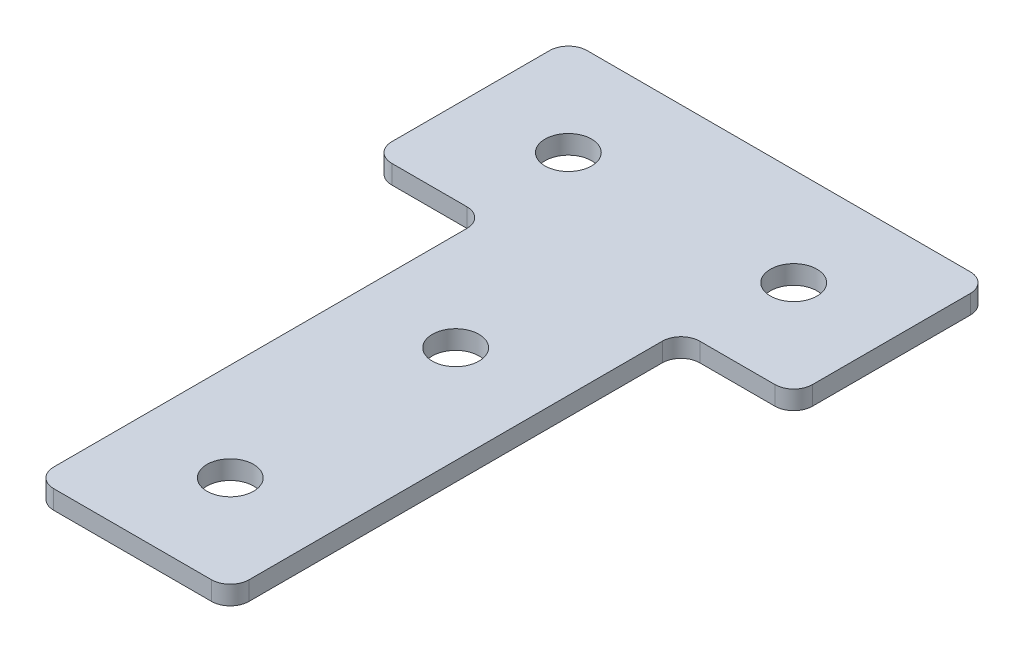
ISO-10303-21;
HEADER;
FILE_DESCRIPTION(('STEP AP214'),'2;1');
FILE_NAME('part.step','',(''),(''),'','','');
FILE_SCHEMA(('AUTOMOTIVE_DESIGN { 1 0 10303 214 1 1 1 1 }'));
ENDSEC;
DATA;
#1=APPLICATION_CONTEXT('core data for automotive mechanical design processes');
#2=APPLICATION_PROTOCOL_DEFINITION('international standard','automotive_design',2000,#1);
#3=PRODUCT_CONTEXT('',#1,'mechanical');
#4=PRODUCT('Part','Part','',(#3));
#5=PRODUCT_RELATED_PRODUCT_CATEGORY('part','',(#4));
#6=PRODUCT_DEFINITION_FORMATION('','',#4);
#7=PRODUCT_DEFINITION_CONTEXT('part definition',#1,'design');
#8=PRODUCT_DEFINITION('design','',#6,#7);
#9=PRODUCT_DEFINITION_SHAPE('','',#8);
#10=(LENGTH_UNIT() NAMED_UNIT(*) SI_UNIT(.MILLI.,.METRE.));
#11=(NAMED_UNIT(*) PLANE_ANGLE_UNIT() SI_UNIT($,.RADIAN.));
#12=(NAMED_UNIT(*) SI_UNIT($,.STERADIAN.) SOLID_ANGLE_UNIT());
#13=UNCERTAINTY_MEASURE_WITH_UNIT(LENGTH_MEASURE(1.E-05),#10,'distance_accuracy_value','');
#14=(GEOMETRIC_REPRESENTATION_CONTEXT(3) GLOBAL_UNCERTAINTY_ASSIGNED_CONTEXT((#13)) GLOBAL_UNIT_ASSIGNED_CONTEXT((#10,
#11,#12)) REPRESENTATION_CONTEXT('',''));
#15=CARTESIAN_POINT('',(0.,0.,0.));
#16=DIRECTION('',(0.,0.,1.));
#17=DIRECTION('',(1.,0.,0.));
#18=AXIS2_PLACEMENT_3D('',#15,#16,#17);
#19=CARTESIAN_POINT('',(-1.96602308443516,2.10790424423976,-31.3913354505916));
#20=DIRECTION('',(0.,-1.,0.));
#21=DIRECTION('',(0.,0.,-1.));
#22=AXIS2_PLACEMENT_3D('',#19,#20,#21);
#23=PLANE('',#22);
#24=CARTESIAN_POINT('',(-1.96602308443517,2.10790424423976,-1.39133545059163));
#25=DIRECTION('',(0.,1.,0.));
#26=DIRECTION('',(0.,0.,1.));
#27=AXIS2_PLACEMENT_3D('',#24,#25,#26);
#28=CIRCLE('',#27,3.1);
#29=CARTESIAN_POINT('',(-1.96602308443517,2.10790424423976,1.70866454940837));
#30=VERTEX_POINT('',#29);
#31=EDGE_CURVE('E206',#30,#30,#28,.T.);
#32=ORIENTED_EDGE('',*,*,#31,.T.);
#33=EDGE_LOOP('',(#32));
#34=FACE_BOUND('',#33,.T.);
#35=DIRECTION('',(1.,0.,0.));
#36=VECTOR('',#35,1.);
#37=CARTESIAN_POINT('',(-14.9660230844353,2.10790424423976,41.6086645494083));
#38=LINE('',#37,#36);
#39=CARTESIAN_POINT('',(-12.4660230844353,2.10790424423976,41.6086645494083));
#40=VERTEX_POINT('',#39);
#41=CARTESIAN_POINT('',(8.53397691556495,2.10790424423976,41.6086645494083));
#42=VERTEX_POINT('',#41);
#43=EDGE_CURVE('E224',#40,#42,#38,.T.);
#44=ORIENTED_EDGE('',*,*,#43,.F.);
#45=CARTESIAN_POINT('',(-12.4660230844353,2.10790424423976,39.1086645494083));
#46=DIRECTION('',(0.,1.,0.));
#47=DIRECTION('',(0.,0.,-1.));
#48=AXIS2_PLACEMENT_3D('',#45,#46,#47);
#49=CIRCLE('',#48,2.5);
#50=CARTESIAN_POINT('',(-14.9660230844353,2.10790424423976,39.1086645494083));
#51=VERTEX_POINT('',#50);
#52=EDGE_CURVE('E156',#51,#40,#49,.T.);
#53=ORIENTED_EDGE('',*,*,#52,.F.);
#54=DIRECTION('',(0.,0.,-1.));
#55=VECTOR('',#54,1.);
#56=CARTESIAN_POINT('',(-14.9660230844353,2.10790424423976,41.6086645494083));
#57=LINE('',#56,#55);
#58=CARTESIAN_POINT('',(-14.9660230844353,2.10790424423976,-15.8913354505916));
#59=VERTEX_POINT('',#58);
#60=EDGE_CURVE('E163',#51,#59,#57,.T.);
#61=ORIENTED_EDGE('',*,*,#60,.T.);
#62=CARTESIAN_POINT('',(-17.4660230844353,2.10790424423976,-15.8913354505916));
#63=DIRECTION('',(0.,1.,0.));
#64=DIRECTION('',(0.,0.,-1.));
#65=AXIS2_PLACEMENT_3D('',#62,#63,#64);
#66=CIRCLE('',#65,2.5);
#67=CARTESIAN_POINT('',(-17.4660230844353,2.10790424423976,-18.3913354505916));
#68=VERTEX_POINT('',#67);
#69=EDGE_CURVE('E196',#68,#59,#66,.F.);
#70=ORIENTED_EDGE('',*,*,#69,.F.);
#71=DIRECTION('',(-1.,0.,0.));
#72=VECTOR('',#71,1.);
#73=CARTESIAN_POINT('',(-14.9660230844353,2.10790424423976,-18.3913354505916));
#74=LINE('',#73,#72);
#75=CARTESIAN_POINT('',(-27.466023084435,2.10790424423976,-18.3913354505916));
#76=VERTEX_POINT('',#75);
#77=EDGE_CURVE('E158',#68,#76,#74,.T.);
#78=ORIENTED_EDGE('',*,*,#77,.T.);
#79=CARTESIAN_POINT('',(-27.466023084435,2.10790424423976,-20.8913354505916));
#80=DIRECTION('',(0.,1.,0.));
#81=DIRECTION('',(0.,0.,-1.));
#82=AXIS2_PLACEMENT_3D('',#79,#80,#81);
#83=CIRCLE('',#82,2.5);
#84=CARTESIAN_POINT('',(-29.966023084435,2.10790424423976,-20.8913354505916));
#85=VERTEX_POINT('',#84);
#86=EDGE_CURVE('E177',#85,#76,#83,.T.);
#87=ORIENTED_EDGE('',*,*,#86,.F.);
#88=DIRECTION('',(0.,0.,-1.));
#89=VECTOR('',#88,1.);
#90=CARTESIAN_POINT('',(-29.966023084435,2.10790424423976,-18.3913354505916));
#91=LINE('',#90,#89);
#92=CARTESIAN_POINT('',(-29.9660230844351,2.10790424423976,-41.8913354505917));
#93=VERTEX_POINT('',#92);
#94=EDGE_CURVE('E285',#85,#93,#91,.T.);
#95=ORIENTED_EDGE('',*,*,#94,.T.);
#96=CARTESIAN_POINT('',(-27.4660230844351,2.10790424423976,-41.8913354505917));
#97=DIRECTION('',(0.,1.,0.));
#98=DIRECTION('',(0.,0.,-1.));
#99=AXIS2_PLACEMENT_3D('',#96,#97,#98);
#100=CIRCLE('',#99,2.5);
#101=CARTESIAN_POINT('',(-27.4660230844351,2.10790424423976,-44.3913354505917));
#102=VERTEX_POINT('',#101);
#103=EDGE_CURVE('E174',#102,#93,#100,.T.);
#104=ORIENTED_EDGE('',*,*,#103,.F.);
#105=DIRECTION('',(-1.,0.,0.));
#106=VECTOR('',#105,1.);
#107=CARTESIAN_POINT('',(26.0339769155647,2.10790424423976,-44.3913354505917));
#108=LINE('',#107,#106);
#109=CARTESIAN_POINT('',(23.5339769155647,2.10790424423976,-44.3913354505917));
#110=VERTEX_POINT('',#109);
#111=EDGE_CURVE('E221',#110,#102,#108,.T.);
#112=ORIENTED_EDGE('',*,*,#111,.F.);
#113=CARTESIAN_POINT('',(23.5339769155647,2.10790424423976,-41.8913354505917));
#114=DIRECTION('',(0.,-1.,0.));
#115=DIRECTION('',(0.,0.,-1.));
#116=AXIS2_PLACEMENT_3D('',#113,#114,#115);
#117=CIRCLE('',#116,2.5);
#118=CARTESIAN_POINT('',(26.0339769155647,2.10790424423976,-41.8913354505917));
#119=VERTEX_POINT('',#118);
#120=EDGE_CURVE('E250',#110,#119,#117,.T.);
#121=ORIENTED_EDGE('',*,*,#120,.T.);
#122=DIRECTION('',(0.,0.,-1.));
#123=VECTOR('',#122,1.);
#124=CARTESIAN_POINT('',(26.0339769155647,2.10790424423976,-18.3913354505916));
#125=LINE('',#124,#123);
#126=CARTESIAN_POINT('',(26.0339769155647,2.10790424423976,-20.8913354505916));
#127=VERTEX_POINT('',#126);
#128=EDGE_CURVE('E218',#127,#119,#125,.T.);
#129=ORIENTED_EDGE('',*,*,#128,.F.);
#130=CARTESIAN_POINT('',(23.5339769155647,2.10790424423976,-20.8913354505916));
#131=DIRECTION('',(0.,-1.,0.));
#132=DIRECTION('',(0.,0.,-1.));
#133=AXIS2_PLACEMENT_3D('',#130,#131,#132);
#134=CIRCLE('',#133,2.5);
#135=CARTESIAN_POINT('',(23.5339769155647,2.10790424423976,-18.3913354505916));
#136=VERTEX_POINT('',#135);
#137=EDGE_CURVE('E31',#127,#136,#134,.T.);
#138=ORIENTED_EDGE('',*,*,#137,.T.);
#139=DIRECTION('',(1.,0.,0.));
#140=VECTOR('',#139,1.);
#141=CARTESIAN_POINT('',(11.0339769155649,2.10790424423976,-18.3913354505916));
#142=LINE('',#141,#140);
#143=CARTESIAN_POINT('',(13.5339769155649,2.10790424423976,-18.3913354505916));
#144=VERTEX_POINT('',#143);
#145=EDGE_CURVE('E229',#144,#136,#142,.T.);
#146=ORIENTED_EDGE('',*,*,#145,.F.);
#147=CARTESIAN_POINT('',(13.5339769155649,2.10790424423976,-15.8913354505916));
#148=DIRECTION('',(0.,-1.,0.));
#149=DIRECTION('',(0.,0.,-1.));
#150=AXIS2_PLACEMENT_3D('',#147,#148,#149);
#151=CIRCLE('',#150,2.5);
#152=CARTESIAN_POINT('',(11.0339769155649,2.10790424423976,-15.8913354505916));
#153=VERTEX_POINT('',#152);
#154=EDGE_CURVE('E10',#144,#153,#151,.F.);
#155=ORIENTED_EDGE('',*,*,#154,.T.);
#156=DIRECTION('',(0.,0.,-1.));
#157=VECTOR('',#156,1.);
#158=CARTESIAN_POINT('',(11.0339769155649,2.10790424423976,41.6086645494083));
#159=LINE('',#158,#157);
#160=CARTESIAN_POINT('',(11.0339769155649,2.10790424423976,39.1086645494083));
#161=VERTEX_POINT('',#160);
#162=EDGE_CURVE('E226',#161,#153,#159,.T.);
#163=ORIENTED_EDGE('',*,*,#162,.F.);
#164=CARTESIAN_POINT('',(8.53397691556495,2.10790424423976,39.1086645494083));
#165=DIRECTION('',(0.,-1.,0.));
#166=DIRECTION('',(0.,0.,-1.));
#167=AXIS2_PLACEMENT_3D('',#164,#165,#166);
#168=CIRCLE('',#167,2.5);
#169=EDGE_CURVE('E253',#161,#42,#168,.T.);
#170=ORIENTED_EDGE('',*,*,#169,.T.);
#171=EDGE_LOOP('',(#44,#53,#61,#70,#78,#87,#95,#104,#112,#121,#129,#138,#146,#155,#163,#170));
#172=FACE_BOUND('',#171,.T.);
#173=CARTESIAN_POINT('',(-1.96602308443517,2.10790424423976,28.6086645494084));
#174=DIRECTION('',(0.,1.,0.));
#175=DIRECTION('',(0.,0.,1.));
#176=AXIS2_PLACEMENT_3D('',#173,#174,#175);
#177=CIRCLE('',#176,3.1);
#178=CARTESIAN_POINT('',(-1.96602308443517,2.10790424423976,31.7086645494084));
#179=VERTEX_POINT('',#178);
#180=EDGE_CURVE('E200',#179,#179,#177,.T.);
#181=ORIENTED_EDGE('',*,*,#180,.T.);
#182=EDGE_LOOP('',(#181));
#183=FACE_BOUND('',#182,.T.);
#184=CARTESIAN_POINT('',(13.0339769155648,2.10790424423976,-31.3913354505916));
#185=DIRECTION('',(0.,1.,0.));
#186=DIRECTION('',(0.,0.,1.));
#187=AXIS2_PLACEMENT_3D('',#184,#185,#186);
#188=CIRCLE('',#187,3.1);
#189=CARTESIAN_POINT('',(13.0339769155648,2.10790424423976,-28.2913354505916));
#190=VERTEX_POINT('',#189);
#191=EDGE_CURVE('E212',#190,#190,#188,.T.);
#192=ORIENTED_EDGE('',*,*,#191,.T.);
#193=EDGE_LOOP('',(#192));
#194=FACE_BOUND('',#193,.T.);
#195=CARTESIAN_POINT('',(-16.9660230844352,2.10790424423976,-31.3913354505916));
#196=DIRECTION('',(0.,-1.,0.));
#197=DIRECTION('',(0.,0.,1.));
#198=AXIS2_PLACEMENT_3D('',#195,#196,#197);
#199=CIRCLE('',#198,3.1);
#200=CARTESIAN_POINT('',(-16.9660230844352,2.10790424423976,-28.2913354505916));
#201=VERTEX_POINT('',#200);
#202=EDGE_CURVE('E293',#201,#201,#199,.T.);
#203=ORIENTED_EDGE('',*,*,#202,.F.);
#204=EDGE_LOOP('',(#203));
#205=FACE_BOUND('',#204,.T.);
#206=ADVANCED_FACE('F16',(#34,#172,#183,#194,#205),#23,.T.);
#207=CARTESIAN_POINT('',(26.0339769155647,2.10790424423976,-18.3913354505916));
#208=DIRECTION('',(1.,0.,0.));
#209=DIRECTION('',(0.,0.,-1.));
#210=AXIS2_PLACEMENT_3D('',#207,#208,#209);
#211=PLANE('',#210);
#212=DIRECTION('',(0.,0.,-1.));
#213=VECTOR('',#212,1.);
#214=CARTESIAN_POINT('',(26.0339769155647,4.60790424423976,-18.3913354505916));
#215=LINE('',#214,#213);
#216=CARTESIAN_POINT('',(26.0339769155647,4.60790424423976,-20.8913354505916));
#217=VERTEX_POINT('',#216);
#218=CARTESIAN_POINT('',(26.0339769155647,4.60790424423976,-41.8913354505917));
#219=VERTEX_POINT('',#218);
#220=EDGE_CURVE('E215',#217,#219,#215,.T.);
#221=ORIENTED_EDGE('',*,*,#220,.F.);
#222=DIRECTION('',(0.,1.,0.));
#223=VECTOR('',#222,1.);
#224=CARTESIAN_POINT('',(26.0339769155647,2.10790424423976,-20.8913354505916));
#225=LINE('',#224,#223);
#226=EDGE_CURVE('E263',#217,#127,#225,.F.);
#227=ORIENTED_EDGE('',*,*,#226,.T.);
#228=ORIENTED_EDGE('',*,*,#128,.T.);
#229=DIRECTION('',(0.,1.,0.));
#230=VECTOR('',#229,1.);
#231=CARTESIAN_POINT('',(26.0339769155647,2.10790424423976,-41.8913354505917));
#232=LINE('',#231,#230);
#233=EDGE_CURVE('E260',#119,#219,#232,.T.);
#234=ORIENTED_EDGE('',*,*,#233,.T.);
#235=EDGE_LOOP('',(#221,#227,#228,#234));
#236=FACE_BOUND('',#235,.T.);
#237=ADVANCED_FACE('F322',(#236),#211,.T.);
#238=CARTESIAN_POINT('',(11.0339769155649,2.10790424423976,-18.3913354505916));
#239=DIRECTION('',(0.,0.,1.));
#240=DIRECTION('',(1.,0.,0.));
#241=AXIS2_PLACEMENT_3D('',#238,#239,#240);
#242=PLANE('',#241);
#243=DIRECTION('',(1.,0.,0.));
#244=VECTOR('',#243,1.);
#245=CARTESIAN_POINT('',(11.0339769155649,4.60790424423976,-18.3913354505916));
#246=LINE('',#245,#244);
#247=CARTESIAN_POINT('',(13.5339769155649,4.60790424423976,-18.3913354505916));
#248=VERTEX_POINT('',#247);
#249=CARTESIAN_POINT('',(23.5339769155647,4.60790424423976,-18.3913354505916));
#250=VERTEX_POINT('',#249);
#251=EDGE_CURVE('E222',#248,#250,#246,.T.);
#252=ORIENTED_EDGE('',*,*,#251,.F.);
#253=DIRECTION('',(0.,1.,0.));
#254=VECTOR('',#253,1.);
#255=CARTESIAN_POINT('',(13.5339769155649,2.10790424423976,-18.3913354505916));
#256=LINE('',#255,#254);
#257=EDGE_CURVE('E38',#248,#144,#256,.F.);
#258=ORIENTED_EDGE('',*,*,#257,.T.);
#259=ORIENTED_EDGE('',*,*,#145,.T.);
#260=DIRECTION('',(0.,1.,0.));
#261=VECTOR('',#260,1.);
#262=CARTESIAN_POINT('',(23.5339769155647,2.10790424423976,-18.3913354505916));
#263=LINE('',#262,#261);
#264=EDGE_CURVE('E256',#136,#250,#263,.T.);
#265=ORIENTED_EDGE('',*,*,#264,.T.);
#266=EDGE_LOOP('',(#252,#258,#259,#265));
#267=FACE_BOUND('',#266,.T.);
#268=ADVANCED_FACE('F269',(#267),#242,.T.);
#269=CARTESIAN_POINT('',(11.0339769155649,2.10790424423976,41.6086645494083));
#270=DIRECTION('',(1.,0.,0.));
#271=DIRECTION('',(0.,0.,-1.));
#272=AXIS2_PLACEMENT_3D('',#269,#270,#271);
#273=PLANE('',#272);
#274=DIRECTION('',(0.,0.,-1.));
#275=VECTOR('',#274,1.);
#276=CARTESIAN_POINT('',(11.0339769155649,4.60790424423976,41.6086645494083));
#277=LINE('',#276,#275);
#278=CARTESIAN_POINT('',(11.0339769155649,4.60790424423976,39.1086645494083));
#279=VERTEX_POINT('',#278);
#280=CARTESIAN_POINT('',(11.0339769155649,4.60790424423976,-15.8913354505916));
#281=VERTEX_POINT('',#280);
#282=EDGE_CURVE('E140',#279,#281,#277,.T.);
#283=ORIENTED_EDGE('',*,*,#282,.F.);
#284=DIRECTION('',(0.,1.,0.));
#285=VECTOR('',#284,1.);
#286=CARTESIAN_POINT('',(11.0339769155649,2.10790424423976,39.1086645494083));
#287=LINE('',#286,#285);
#288=EDGE_CURVE('E248',#279,#161,#287,.F.);
#289=ORIENTED_EDGE('',*,*,#288,.T.);
#290=ORIENTED_EDGE('',*,*,#162,.T.);
#291=DIRECTION('',(0.,1.,0.));
#292=VECTOR('',#291,1.);
#293=CARTESIAN_POINT('',(11.0339769155649,4.60790424423976,-15.8913354505916));
#294=LINE('',#293,#292);
#295=EDGE_CURVE('E245',#153,#281,#294,.T.);
#296=ORIENTED_EDGE('',*,*,#295,.T.);
#297=EDGE_LOOP('',(#283,#289,#290,#296));
#298=FACE_BOUND('',#297,.T.);
#299=ADVANCED_FACE('F277',(#298),#273,.T.);
#300=CARTESIAN_POINT('',(-14.9660230844353,2.10790424423976,41.6086645494083));
#301=DIRECTION('',(0.,0.,1.));
#302=DIRECTION('',(1.,0.,0.));
#303=AXIS2_PLACEMENT_3D('',#300,#301,#302);
#304=PLANE('',#303);
#305=DIRECTION('',(1.,0.,0.));
#306=VECTOR('',#305,1.);
#307=CARTESIAN_POINT('',(-14.9660230844353,4.60790424423976,41.6086645494083));
#308=LINE('',#307,#306);
#309=CARTESIAN_POINT('',(-12.4660230844353,4.60790424423976,41.6086645494083));
#310=VERTEX_POINT('',#309);
#311=CARTESIAN_POINT('',(8.53397691556495,4.60790424423976,41.6086645494083));
#312=VERTEX_POINT('',#311);
#313=EDGE_CURVE('E130',#310,#312,#308,.T.);
#314=ORIENTED_EDGE('',*,*,#313,.F.);
#315=DIRECTION('',(0.,1.,0.));
#316=VECTOR('',#315,1.);
#317=CARTESIAN_POINT('',(-12.4660230844353,2.10790424423976,41.6086645494083));
#318=LINE('',#317,#316);
#319=EDGE_CURVE('E134',#40,#310,#318,.T.);
#320=ORIENTED_EDGE('',*,*,#319,.F.);
#321=ORIENTED_EDGE('',*,*,#43,.T.);
#322=DIRECTION('',(0.,1.,0.));
#323=VECTOR('',#322,1.);
#324=CARTESIAN_POINT('',(8.53397691556495,2.10790424423976,41.6086645494083));
#325=LINE('',#324,#323);
#326=EDGE_CURVE('E137',#42,#312,#325,.T.);
#327=ORIENTED_EDGE('',*,*,#326,.T.);
#328=EDGE_LOOP('',(#314,#320,#321,#327));
#329=FACE_BOUND('',#328,.T.);
#330=ADVANCED_FACE('F132',(#329),#304,.T.);
#331=CARTESIAN_POINT('',(26.0339769155647,2.10790424423976,-44.3913354505917));
#332=DIRECTION('',(0.,0.,-1.));
#333=DIRECTION('',(-1.,0.,0.));
#334=AXIS2_PLACEMENT_3D('',#331,#332,#333);
#335=PLANE('',#334);
#336=ORIENTED_EDGE('',*,*,#111,.T.);
#337=DIRECTION('',(0.,1.,0.));
#338=VECTOR('',#337,1.);
#339=CARTESIAN_POINT('',(-27.4660230844351,2.10790424423976,-44.3913354505917));
#340=LINE('',#339,#338);
#341=CARTESIAN_POINT('',(-27.4660230844351,4.60790424423976,-44.3913354505917));
#342=VERTEX_POINT('',#341);
#343=EDGE_CURVE('E191',#342,#102,#340,.F.);
#344=ORIENTED_EDGE('',*,*,#343,.F.);
#345=DIRECTION('',(-1.,0.,0.));
#346=VECTOR('',#345,1.);
#347=CARTESIAN_POINT('',(26.0339769155647,4.60790424423976,-44.3913354505917));
#348=LINE('',#347,#346);
#349=CARTESIAN_POINT('',(23.5339769155647,4.60790424423976,-44.3913354505917));
#350=VERTEX_POINT('',#349);
#351=EDGE_CURVE('E141',#350,#342,#348,.T.);
#352=ORIENTED_EDGE('',*,*,#351,.F.);
#353=DIRECTION('',(0.,1.,0.));
#354=VECTOR('',#353,1.);
#355=CARTESIAN_POINT('',(23.5339769155647,2.10790424423976,-44.3913354505917));
#356=LINE('',#355,#354);
#357=EDGE_CURVE('E265',#350,#110,#356,.F.);
#358=ORIENTED_EDGE('',*,*,#357,.T.);
#359=EDGE_LOOP('',(#336,#344,#352,#358));
#360=FACE_BOUND('',#359,.T.);
#361=ADVANCED_FACE('F315',(#360),#335,.T.);
#362=CARTESIAN_POINT('',(-1.96602308443516,4.60790424423976,-31.3913354505916));
#363=DIRECTION('',(0.,-1.,0.));
#364=DIRECTION('',(0.,0.,-1.));
#365=AXIS2_PLACEMENT_3D('',#362,#363,#364);
#366=PLANE('',#365);
#367=CARTESIAN_POINT('',(-1.96602308443517,4.60790424423976,-1.39133545059163));
#368=DIRECTION('',(0.,1.,0.));
#369=DIRECTION('',(0.,0.,1.));
#370=AXIS2_PLACEMENT_3D('',#367,#368,#369);
#371=CIRCLE('',#370,3.1);
#372=CARTESIAN_POINT('',(-1.96602308443517,4.60790424423976,1.70866454940837));
#373=VERTEX_POINT('',#372);
#374=EDGE_CURVE('E203',#373,#373,#371,.T.);
#375=ORIENTED_EDGE('',*,*,#374,.F.);
#376=EDGE_LOOP('',(#375));
#377=FACE_BOUND('',#376,.T.);
#378=CARTESIAN_POINT('',(-12.4660230844353,4.60790424423976,39.1086645494083));
#379=DIRECTION('',(0.,1.,0.));
#380=DIRECTION('',(0.,0.,-1.));
#381=AXIS2_PLACEMENT_3D('',#378,#379,#380);
#382=CIRCLE('',#381,2.5);
#383=CARTESIAN_POINT('',(-14.9660230844353,4.60790424423976,39.1086645494083));
#384=VERTEX_POINT('',#383);
#385=EDGE_CURVE('E144',#310,#384,#382,.F.);
#386=ORIENTED_EDGE('',*,*,#385,.F.);
#387=ORIENTED_EDGE('',*,*,#313,.T.);
#388=CARTESIAN_POINT('',(8.53397691556495,4.60790424423976,39.1086645494083));
#389=DIRECTION('',(0.,-1.,0.));
#390=DIRECTION('',(0.,0.,-1.));
#391=AXIS2_PLACEMENT_3D('',#388,#389,#390);
#392=CIRCLE('',#391,2.5);
#393=EDGE_CURVE('E243',#312,#279,#392,.F.);
#394=ORIENTED_EDGE('',*,*,#393,.T.);
#395=ORIENTED_EDGE('',*,*,#282,.T.);
#396=CARTESIAN_POINT('',(13.5339769155649,4.60790424423976,-15.8913354505916));
#397=DIRECTION('',(0.,-1.,0.));
#398=DIRECTION('',(0.,0.,-1.));
#399=AXIS2_PLACEMENT_3D('',#396,#397,#398);
#400=CIRCLE('',#399,2.5);
#401=EDGE_CURVE('E24',#281,#248,#400,.T.);
#402=ORIENTED_EDGE('',*,*,#401,.T.);
#403=ORIENTED_EDGE('',*,*,#251,.T.);
#404=CARTESIAN_POINT('',(23.5339769155647,4.60790424423976,-20.8913354505916));
#405=DIRECTION('',(0.,-1.,0.));
#406=DIRECTION('',(0.,0.,-1.));
#407=AXIS2_PLACEMENT_3D('',#404,#405,#406);
#408=CIRCLE('',#407,2.5);
#409=EDGE_CURVE('E241',#250,#217,#408,.F.);
#410=ORIENTED_EDGE('',*,*,#409,.T.);
#411=ORIENTED_EDGE('',*,*,#220,.T.);
#412=CARTESIAN_POINT('',(23.5339769155647,4.60790424423976,-41.8913354505917));
#413=DIRECTION('',(0.,-1.,0.));
#414=DIRECTION('',(0.,0.,-1.));
#415=AXIS2_PLACEMENT_3D('',#412,#413,#414);
#416=CIRCLE('',#415,2.5);
#417=EDGE_CURVE('E239',#219,#350,#416,.F.);
#418=ORIENTED_EDGE('',*,*,#417,.T.);
#419=ORIENTED_EDGE('',*,*,#351,.T.);
#420=CARTESIAN_POINT('',(-27.4660230844351,4.60790424423976,-41.8913354505917));
#421=DIRECTION('',(0.,1.,0.));
#422=DIRECTION('',(0.,0.,-1.));
#423=AXIS2_PLACEMENT_3D('',#420,#421,#422);
#424=CIRCLE('',#423,2.5);
#425=CARTESIAN_POINT('',(-29.9660230844351,4.60790424423976,-41.8913354505917));
#426=VERTEX_POINT('',#425);
#427=EDGE_CURVE('E157',#426,#342,#424,.F.);
#428=ORIENTED_EDGE('',*,*,#427,.F.);
#429=DIRECTION('',(0.,0.,-1.));
#430=VECTOR('',#429,1.);
#431=CARTESIAN_POINT('',(-29.966023084435,4.60790424423976,-18.3913354505916));
#432=LINE('',#431,#430);
#433=CARTESIAN_POINT('',(-29.966023084435,4.60790424423976,-20.8913354505916));
#434=VERTEX_POINT('',#433);
#435=EDGE_CURVE('E291',#434,#426,#432,.T.);
#436=ORIENTED_EDGE('',*,*,#435,.F.);
#437=CARTESIAN_POINT('',(-27.466023084435,4.60790424423976,-20.8913354505916));
#438=DIRECTION('',(0.,1.,0.));
#439=DIRECTION('',(0.,0.,-1.));
#440=AXIS2_PLACEMENT_3D('',#437,#438,#439);
#441=CIRCLE('',#440,2.5);
#442=CARTESIAN_POINT('',(-27.466023084435,4.60790424423976,-18.3913354505916));
#443=VERTEX_POINT('',#442);
#444=EDGE_CURVE('E152',#443,#434,#441,.F.);
#445=ORIENTED_EDGE('',*,*,#444,.F.);
#446=DIRECTION('',(-1.,0.,0.));
#447=VECTOR('',#446,1.);
#448=CARTESIAN_POINT('',(-14.9660230844353,4.60790424423976,-18.3913354505916));
#449=LINE('',#448,#447);
#450=CARTESIAN_POINT('',(-17.4660230844353,4.60790424423976,-18.3913354505916));
#451=VERTEX_POINT('',#450);
#452=EDGE_CURVE('E166',#451,#443,#449,.T.);
#453=ORIENTED_EDGE('',*,*,#452,.F.);
#454=CARTESIAN_POINT('',(-17.4660230844353,4.60790424423976,-15.8913354505916));
#455=DIRECTION('',(0.,1.,0.));
#456=DIRECTION('',(0.,0.,-1.));
#457=AXIS2_PLACEMENT_3D('',#454,#455,#456);
#458=CIRCLE('',#457,2.5);
#459=CARTESIAN_POINT('',(-14.9660230844353,4.60790424423976,-15.8913354505916));
#460=VERTEX_POINT('',#459);
#461=EDGE_CURVE('E194',#460,#451,#458,.T.);
#462=ORIENTED_EDGE('',*,*,#461,.F.);
#463=DIRECTION('',(0.,0.,-1.));
#464=VECTOR('',#463,1.);
#465=CARTESIAN_POINT('',(-14.9660230844353,4.60790424423976,41.6086645494083));
#466=LINE('',#465,#464);
#467=EDGE_CURVE('E148',#384,#460,#466,.T.);
#468=ORIENTED_EDGE('',*,*,#467,.F.);
#469=EDGE_LOOP('',(#386,#387,#394,#395,#402,#403,#410,#411,#418,#419,#428,#436,#445,#453,#462,#468));
#470=FACE_BOUND('',#469,.T.);
#471=CARTESIAN_POINT('',(-1.96602308443517,4.60790424423976,28.6086645494084));
#472=DIRECTION('',(0.,1.,0.));
#473=DIRECTION('',(0.,0.,1.));
#474=AXIS2_PLACEMENT_3D('',#471,#472,#473);
#475=CIRCLE('',#474,3.1);
#476=CARTESIAN_POINT('',(-1.96602308443517,4.60790424423976,31.7086645494084));
#477=VERTEX_POINT('',#476);
#478=EDGE_CURVE('E199',#477,#477,#475,.T.);
#479=ORIENTED_EDGE('',*,*,#478,.F.);
#480=EDGE_LOOP('',(#479));
#481=FACE_BOUND('',#480,.T.);
#482=CARTESIAN_POINT('',(13.0339769155648,4.60790424423976,-31.3913354505916));
#483=DIRECTION('',(0.,1.,0.));
#484=DIRECTION('',(0.,0.,1.));
#485=AXIS2_PLACEMENT_3D('',#482,#483,#484);
#486=CIRCLE('',#485,3.1);
#487=CARTESIAN_POINT('',(13.0339769155648,4.60790424423976,-28.2913354505916));
#488=VERTEX_POINT('',#487);
#489=EDGE_CURVE('E209',#488,#488,#486,.T.);
#490=ORIENTED_EDGE('',*,*,#489,.F.);
#491=EDGE_LOOP('',(#490));
#492=FACE_BOUND('',#491,.T.);
#493=CARTESIAN_POINT('',(-16.9660230844352,4.60790424423976,-31.3913354505916));
#494=DIRECTION('',(0.,-1.,0.));
#495=DIRECTION('',(0.,0.,1.));
#496=AXIS2_PLACEMENT_3D('',#493,#494,#495);
#497=CIRCLE('',#496,3.1);
#498=CARTESIAN_POINT('',(-16.9660230844352,4.60790424423976,-28.2913354505916));
#499=VERTEX_POINT('',#498);
#500=EDGE_CURVE('E507',#499,#499,#497,.T.);
#501=ORIENTED_EDGE('',*,*,#500,.T.);
#502=EDGE_LOOP('',(#501));
#503=FACE_BOUND('',#502,.T.);
#504=ADVANCED_FACE('F145',(#377,#470,#481,#492,#503),#366,.F.);
#505=CARTESIAN_POINT('',(8.53397691556495,2.10790424423976,39.1086645494083));
#506=DIRECTION('',(0.,1.,0.));
#507=DIRECTION('',(0.,0.,1.));
#508=AXIS2_PLACEMENT_3D('',#505,#506,#507);
#509=CYLINDRICAL_SURFACE('',#508,2.5);
#510=ORIENTED_EDGE('',*,*,#169,.F.);
#511=ORIENTED_EDGE('',*,*,#288,.F.);
#512=ORIENTED_EDGE('',*,*,#393,.F.);
#513=ORIENTED_EDGE('',*,*,#326,.F.);
#514=EDGE_LOOP('',(#510,#511,#512,#513));
#515=FACE_BOUND('',#514,.T.);
#516=ADVANCED_FACE('F280',(#515),#509,.T.);
#517=CARTESIAN_POINT('',(13.5339769155649,2.10790424423976,-15.8913354505916));
#518=DIRECTION('',(0.,-1.,0.));
#519=DIRECTION('',(0.,0.,-1.));
#520=AXIS2_PLACEMENT_3D('',#517,#518,#519);
#521=CYLINDRICAL_SURFACE('',#520,2.5);
#522=ORIENTED_EDGE('',*,*,#154,.F.);
#523=ORIENTED_EDGE('',*,*,#257,.F.);
#524=ORIENTED_EDGE('',*,*,#401,.F.);
#525=ORIENTED_EDGE('',*,*,#295,.F.);
#526=EDGE_LOOP('',(#522,#523,#524,#525));
#527=FACE_BOUND('',#526,.T.);
#528=ADVANCED_FACE('F272',(#527),#521,.F.);
#529=CARTESIAN_POINT('',(23.5339769155647,2.10790424423976,-20.8913354505916));
#530=DIRECTION('',(0.,1.,0.));
#531=DIRECTION('',(0.,0.,1.));
#532=AXIS2_PLACEMENT_3D('',#529,#530,#531);
#533=CYLINDRICAL_SURFACE('',#532,2.5);
#534=ORIENTED_EDGE('',*,*,#137,.F.);
#535=ORIENTED_EDGE('',*,*,#226,.F.);
#536=ORIENTED_EDGE('',*,*,#409,.F.);
#537=ORIENTED_EDGE('',*,*,#264,.F.);
#538=EDGE_LOOP('',(#534,#535,#536,#537));
#539=FACE_BOUND('',#538,.T.);
#540=ADVANCED_FACE('F325',(#539),#533,.T.);
#541=CARTESIAN_POINT('',(23.5339769155647,2.10790424423976,-41.8913354505917));
#542=DIRECTION('',(0.,1.,0.));
#543=DIRECTION('',(0.,0.,1.));
#544=AXIS2_PLACEMENT_3D('',#541,#542,#543);
#545=CYLINDRICAL_SURFACE('',#544,2.5);
#546=ORIENTED_EDGE('',*,*,#120,.F.);
#547=ORIENTED_EDGE('',*,*,#357,.F.);
#548=ORIENTED_EDGE('',*,*,#417,.F.);
#549=ORIENTED_EDGE('',*,*,#233,.F.);
#550=EDGE_LOOP('',(#546,#547,#548,#549));
#551=FACE_BOUND('',#550,.T.);
#552=ADVANCED_FACE('F18',(#551),#545,.T.);
#553=CARTESIAN_POINT('',(13.0339769155648,2.10790424423976,-31.3913354505916));
#554=DIRECTION('',(0.,1.,0.));
#555=DIRECTION('',(0.,0.,1.));
#556=AXIS2_PLACEMENT_3D('',#553,#554,#555);
#557=CYLINDRICAL_SURFACE('',#556,3.1);
#558=ORIENTED_EDGE('',*,*,#191,.F.);
#559=EDGE_LOOP('',(#558));
#560=FACE_BOUND('',#559,.T.);
#561=ORIENTED_EDGE('',*,*,#489,.T.);
#562=EDGE_LOOP('',(#561));
#563=FACE_BOUND('',#562,.T.);
#564=ADVANCED_FACE('F332',(#560,#563),#557,.F.);
#565=CARTESIAN_POINT('',(-1.96602308443517,2.10790424423976,-1.39133545059163));
#566=DIRECTION('',(0.,1.,0.));
#567=DIRECTION('',(0.,0.,1.));
#568=AXIS2_PLACEMENT_3D('',#565,#566,#567);
#569=CYLINDRICAL_SURFACE('',#568,3.1);
#570=ORIENTED_EDGE('',*,*,#31,.F.);
#571=EDGE_LOOP('',(#570));
#572=FACE_BOUND('',#571,.T.);
#573=ORIENTED_EDGE('',*,*,#374,.T.);
#574=EDGE_LOOP('',(#573));
#575=FACE_BOUND('',#574,.T.);
#576=ADVANCED_FACE('F354',(#572,#575),#569,.F.);
#577=CARTESIAN_POINT('',(-1.96602308443517,2.10790424423976,28.6086645494084));
#578=DIRECTION('',(0.,1.,0.));
#579=DIRECTION('',(0.,0.,1.));
#580=AXIS2_PLACEMENT_3D('',#577,#578,#579);
#581=CYLINDRICAL_SURFACE('',#580,3.1);
#582=ORIENTED_EDGE('',*,*,#478,.T.);
#583=EDGE_LOOP('',(#582));
#584=FACE_BOUND('',#583,.T.);
#585=ORIENTED_EDGE('',*,*,#180,.F.);
#586=EDGE_LOOP('',(#585));
#587=FACE_BOUND('',#586,.T.);
#588=ADVANCED_FACE('F356',(#584,#587),#581,.F.);
#589=CARTESIAN_POINT('',(-29.966023084435,2.10790424423976,-18.3913354505916));
#590=DIRECTION('',(-1.,0.,0.));
#591=DIRECTION('',(0.,0.,-1.));
#592=AXIS2_PLACEMENT_3D('',#589,#590,#591);
#593=PLANE('',#592);
#594=ORIENTED_EDGE('',*,*,#435,.T.);
#595=DIRECTION('',(0.,1.,0.));
#596=VECTOR('',#595,1.);
#597=CARTESIAN_POINT('',(-29.9660230844351,2.10790424423976,-41.8913354505917));
#598=LINE('',#597,#596);
#599=EDGE_CURVE('E186',#93,#426,#598,.T.);
#600=ORIENTED_EDGE('',*,*,#599,.F.);
#601=ORIENTED_EDGE('',*,*,#94,.F.);
#602=DIRECTION('',(0.,1.,0.));
#603=VECTOR('',#602,1.);
#604=CARTESIAN_POINT('',(-29.966023084435,2.10790424423976,-20.8913354505916));
#605=LINE('',#604,#603);
#606=EDGE_CURVE('E189',#434,#85,#605,.F.);
#607=ORIENTED_EDGE('',*,*,#606,.F.);
#608=EDGE_LOOP('',(#594,#600,#601,#607));
#609=FACE_BOUND('',#608,.T.);
#610=ADVANCED_FACE('F309',(#609),#593,.T.);
#611=CARTESIAN_POINT('',(-14.9660230844353,2.10790424423976,-18.3913354505916));
#612=DIRECTION('',(0.,0.,1.));
#613=DIRECTION('',(-1.,0.,0.));
#614=AXIS2_PLACEMENT_3D('',#611,#612,#613);
#615=PLANE('',#614);
#616=ORIENTED_EDGE('',*,*,#452,.T.);
#617=DIRECTION('',(0.,1.,0.));
#618=VECTOR('',#617,1.);
#619=CARTESIAN_POINT('',(-27.466023084435,2.10790424423976,-18.3913354505916));
#620=LINE('',#619,#618);
#621=EDGE_CURVE('E181',#76,#443,#620,.T.);
#622=ORIENTED_EDGE('',*,*,#621,.F.);
#623=ORIENTED_EDGE('',*,*,#77,.F.);
#624=DIRECTION('',(0.,1.,0.));
#625=VECTOR('',#624,1.);
#626=CARTESIAN_POINT('',(-17.4660230844353,2.10790424423976,-18.3913354505916));
#627=LINE('',#626,#625);
#628=EDGE_CURVE('E184',#451,#68,#627,.F.);
#629=ORIENTED_EDGE('',*,*,#628,.F.);
#630=EDGE_LOOP('',(#616,#622,#623,#629));
#631=FACE_BOUND('',#630,.T.);
#632=ADVANCED_FACE('F298',(#631),#615,.T.);
#633=CARTESIAN_POINT('',(-14.9660230844353,2.10790424423976,41.6086645494083));
#634=DIRECTION('',(-1.,0.,0.));
#635=DIRECTION('',(0.,0.,-1.));
#636=AXIS2_PLACEMENT_3D('',#633,#634,#635);
#637=PLANE('',#636);
#638=ORIENTED_EDGE('',*,*,#467,.T.);
#639=DIRECTION('',(0.,1.,0.));
#640=VECTOR('',#639,1.);
#641=CARTESIAN_POINT('',(-14.9660230844353,4.60790424423976,-15.8913354505916));
#642=LINE('',#641,#640);
#643=EDGE_CURVE('E151',#59,#460,#642,.T.);
#644=ORIENTED_EDGE('',*,*,#643,.F.);
#645=ORIENTED_EDGE('',*,*,#60,.F.);
#646=DIRECTION('',(0.,1.,0.));
#647=VECTOR('',#646,1.);
#648=CARTESIAN_POINT('',(-14.9660230844353,2.10790424423976,39.1086645494083));
#649=LINE('',#648,#647);
#650=EDGE_CURVE('E172',#384,#51,#649,.F.);
#651=ORIENTED_EDGE('',*,*,#650,.F.);
#652=EDGE_LOOP('',(#638,#644,#645,#651));
#653=FACE_BOUND('',#652,.T.);
#654=ADVANCED_FACE('F445',(#653),#637,.T.);
#655=CARTESIAN_POINT('',(-12.4660230844353,2.10790424423976,39.1086645494083));
#656=DIRECTION('',(0.,1.,0.));
#657=DIRECTION('',(0.,0.,1.));
#658=AXIS2_PLACEMENT_3D('',#655,#656,#657);
#659=CYLINDRICAL_SURFACE('',#658,2.5);
#660=ORIENTED_EDGE('',*,*,#52,.T.);
#661=ORIENTED_EDGE('',*,*,#319,.T.);
#662=ORIENTED_EDGE('',*,*,#385,.T.);
#663=ORIENTED_EDGE('',*,*,#650,.T.);
#664=EDGE_LOOP('',(#660,#661,#662,#663));
#665=FACE_BOUND('',#664,.T.);
#666=ADVANCED_FACE('F154',(#665),#659,.T.);
#667=CARTESIAN_POINT('',(-17.4660230844353,2.10790424423976,-15.8913354505916));
#668=DIRECTION('',(0.,-1.,0.));
#669=DIRECTION('',(0.,0.,-1.));
#670=AXIS2_PLACEMENT_3D('',#667,#668,#669);
#671=CYLINDRICAL_SURFACE('',#670,2.5);
#672=ORIENTED_EDGE('',*,*,#69,.T.);
#673=ORIENTED_EDGE('',*,*,#643,.T.);
#674=ORIENTED_EDGE('',*,*,#461,.T.);
#675=ORIENTED_EDGE('',*,*,#628,.T.);
#676=EDGE_LOOP('',(#672,#673,#674,#675));
#677=FACE_BOUND('',#676,.T.);
#678=ADVANCED_FACE('F462',(#677),#671,.F.);
#679=CARTESIAN_POINT('',(-27.466023084435,2.10790424423976,-20.8913354505916));
#680=DIRECTION('',(0.,1.,0.));
#681=DIRECTION('',(0.,0.,1.));
#682=AXIS2_PLACEMENT_3D('',#679,#680,#681);
#683=CYLINDRICAL_SURFACE('',#682,2.5);
#684=ORIENTED_EDGE('',*,*,#86,.T.);
#685=ORIENTED_EDGE('',*,*,#621,.T.);
#686=ORIENTED_EDGE('',*,*,#444,.T.);
#687=ORIENTED_EDGE('',*,*,#606,.T.);
#688=EDGE_LOOP('',(#684,#685,#686,#687));
#689=FACE_BOUND('',#688,.T.);
#690=ADVANCED_FACE('F303',(#689),#683,.T.);
#691=CARTESIAN_POINT('',(-27.4660230844351,2.10790424423976,-41.8913354505917));
#692=DIRECTION('',(0.,1.,0.));
#693=DIRECTION('',(0.,0.,1.));
#694=AXIS2_PLACEMENT_3D('',#691,#692,#693);
#695=CYLINDRICAL_SURFACE('',#694,2.5);
#696=ORIENTED_EDGE('',*,*,#103,.T.);
#697=ORIENTED_EDGE('',*,*,#599,.T.);
#698=ORIENTED_EDGE('',*,*,#427,.T.);
#699=ORIENTED_EDGE('',*,*,#343,.T.);
#700=EDGE_LOOP('',(#696,#697,#698,#699));
#701=FACE_BOUND('',#700,.T.);
#702=ADVANCED_FACE('F311',(#701),#695,.T.);
#703=CARTESIAN_POINT('',(-16.9660230844352,2.10790424423976,-31.3913354505916));
#704=DIRECTION('',(0.,1.,0.));
#705=DIRECTION('',(0.,0.,1.));
#706=AXIS2_PLACEMENT_3D('',#703,#704,#705);
#707=CYLINDRICAL_SURFACE('',#706,3.1);
#708=ORIENTED_EDGE('',*,*,#202,.T.);
#709=EDGE_LOOP('',(#708));
#710=FACE_BOUND('',#709,.T.);
#711=ORIENTED_EDGE('',*,*,#500,.F.);
#712=EDGE_LOOP('',(#711));
#713=FACE_BOUND('',#712,.T.);
#714=ADVANCED_FACE('F488',(#710,#713),#707,.F.);
#715=CLOSED_SHELL('',(#206,#237,#268,#299,#330,#361,#504,#516,#528,#540,#552,#564,#576,#588,
#610,#632,#654,#666,#678,#690,#702,#714));
#716=MANIFOLD_SOLID_BREP('B1',#715);
#717=ADVANCED_BREP_SHAPE_REPRESENTATION('',(#18,#716),#14);
#718=SHAPE_DEFINITION_REPRESENTATION(#9,#717);
ENDSEC;
END-ISO-10303-21;
